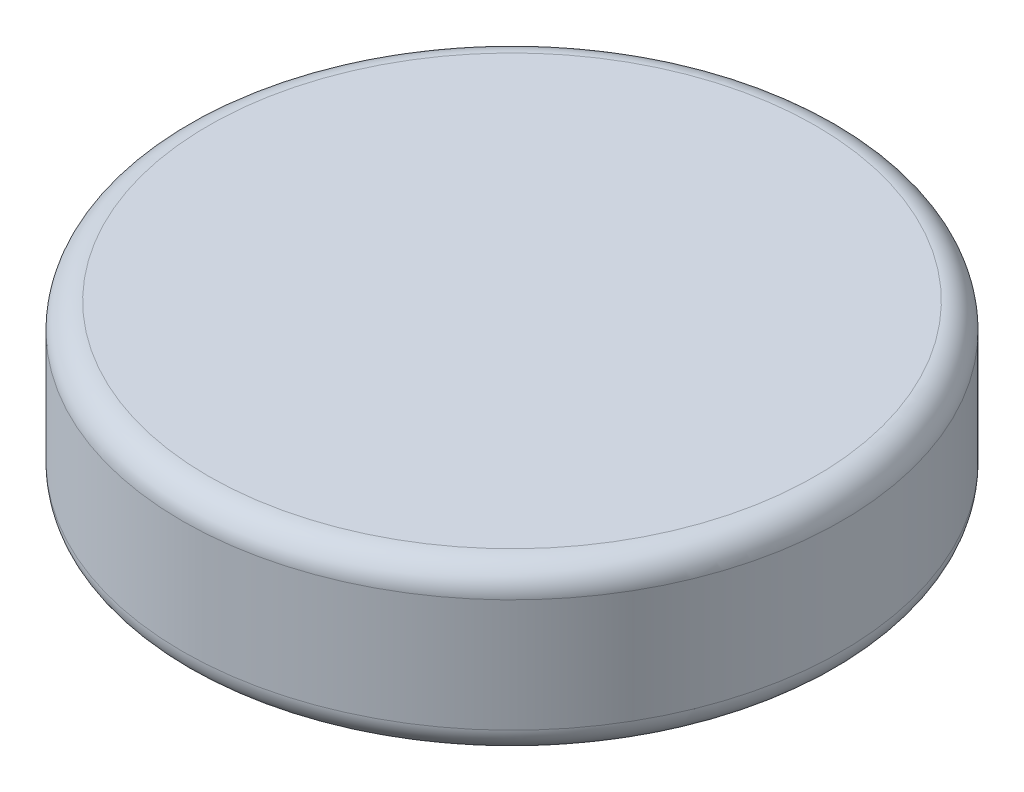
ISO-10303-21;
HEADER;
FILE_DESCRIPTION(('STEP AP214'),'2;1');
FILE_NAME('part.step','',(''),(''),'','','');
FILE_SCHEMA(('AUTOMOTIVE_DESIGN { 1 0 10303 214 1 1 1 1 }'));
ENDSEC;
DATA;
#1=APPLICATION_CONTEXT('core data for automotive mechanical design processes');
#2=APPLICATION_PROTOCOL_DEFINITION('international standard','automotive_design',2000,#1);
#3=PRODUCT_CONTEXT('',#1,'mechanical');
#4=PRODUCT('Part','Part','',(#3));
#5=PRODUCT_RELATED_PRODUCT_CATEGORY('part','',(#4));
#6=PRODUCT_DEFINITION_FORMATION('','',#4);
#7=PRODUCT_DEFINITION_CONTEXT('part definition',#1,'design');
#8=PRODUCT_DEFINITION('design','',#6,#7);
#9=PRODUCT_DEFINITION_SHAPE('','',#8);
#10=(LENGTH_UNIT() NAMED_UNIT(*) SI_UNIT(.MILLI.,.METRE.));
#11=(NAMED_UNIT(*) PLANE_ANGLE_UNIT() SI_UNIT($,.RADIAN.));
#12=(NAMED_UNIT(*) SI_UNIT($,.STERADIAN.) SOLID_ANGLE_UNIT());
#13=UNCERTAINTY_MEASURE_WITH_UNIT(LENGTH_MEASURE(1.E-05),#10,'distance_accuracy_value','');
#14=(GEOMETRIC_REPRESENTATION_CONTEXT(3) GLOBAL_UNCERTAINTY_ASSIGNED_CONTEXT((#13)) GLOBAL_UNIT_ASSIGNED_CONTEXT((#10,
#11,#12)) REPRESENTATION_CONTEXT('',''));
#15=CARTESIAN_POINT('',(0.,0.,0.));
#16=DIRECTION('',(0.,0.,1.));
#17=DIRECTION('',(1.,0.,0.));
#18=AXIS2_PLACEMENT_3D('',#15,#16,#17);
#19=CARTESIAN_POINT('',(0.,1.5875,0.));
#20=DIRECTION('',(0.,-1.,0.));
#21=DIRECTION('',(0.,0.,-1.));
#22=AXIS2_PLACEMENT_3D('',#19,#20,#21);
#23=CYLINDRICAL_SURFACE('',#22,3.175);
#24=CARTESIAN_POINT('',(0.,0.25,0.));
#25=DIRECTION('',(0.,1.,0.));
#26=DIRECTION('',(0.,0.,1.));
#27=AXIS2_PLACEMENT_3D('',#24,#25,#26);
#28=CIRCLE('',#27,3.175);
#29=CARTESIAN_POINT('',(0.,0.25,3.175));
#30=VERTEX_POINT('',#29);
#31=EDGE_CURVE('E42',#30,#30,#28,.T.);
#32=ORIENTED_EDGE('',*,*,#31,.T.);
#33=EDGE_LOOP('',(#32));
#34=FACE_BOUND('',#33,.T.);
#35=CARTESIAN_POINT('',(0.,1.3375,0.));
#36=DIRECTION('',(0.,1.,0.));
#37=DIRECTION('',(0.,0.,1.));
#38=AXIS2_PLACEMENT_3D('',#35,#36,#37);
#39=CIRCLE('',#38,3.175);
#40=CARTESIAN_POINT('',(0.,1.3375,3.175));
#41=VERTEX_POINT('',#40);
#42=EDGE_CURVE('E46',#41,#41,#39,.F.);
#43=ORIENTED_EDGE('',*,*,#42,.T.);
#44=EDGE_LOOP('',(#43));
#45=FACE_BOUND('',#44,.T.);
#46=ADVANCED_FACE('F31',(#34,#45),#23,.T.);
#47=CARTESIAN_POINT('',(0.,1.5875,0.));
#48=DIRECTION('',(0.,1.,0.));
#49=DIRECTION('',(0.,0.,1.));
#50=AXIS2_PLACEMENT_3D('',#47,#48,#49);
#51=PLANE('',#50);
#52=CARTESIAN_POINT('',(0.,1.5875,0.));
#53=DIRECTION('',(0.,1.,0.));
#54=DIRECTION('',(0.,0.,1.));
#55=AXIS2_PLACEMENT_3D('',#52,#53,#54);
#56=CIRCLE('',#55,2.925);
#57=CARTESIAN_POINT('',(0.,1.5875,2.925));
#58=VERTEX_POINT('',#57);
#59=EDGE_CURVE('E10',#58,#58,#56,.T.);
#60=ORIENTED_EDGE('',*,*,#59,.T.);
#61=EDGE_LOOP('',(#60));
#62=FACE_BOUND('',#61,.T.);
#63=ADVANCED_FACE('F62',(#62),#51,.T.);
#64=CARTESIAN_POINT('',(0.,0.,0.));
#65=DIRECTION('',(0.,1.,0.));
#66=DIRECTION('',(0.,0.,1.));
#67=AXIS2_PLACEMENT_3D('',#64,#65,#66);
#68=PLANE('',#67);
#69=CARTESIAN_POINT('',(0.,0.,0.));
#70=DIRECTION('',(0.,1.,0.));
#71=DIRECTION('',(0.,0.,1.));
#72=AXIS2_PLACEMENT_3D('',#69,#70,#71);
#73=CIRCLE('',#72,2.925);
#74=CARTESIAN_POINT('',(0.,0.,2.925));
#75=VERTEX_POINT('',#74);
#76=EDGE_CURVE('E38',#75,#75,#73,.F.);
#77=ORIENTED_EDGE('',*,*,#76,.T.);
#78=EDGE_LOOP('',(#77));
#79=FACE_BOUND('',#78,.T.);
#80=ADVANCED_FACE('F59',(#79),#68,.F.);
#81=CARTESIAN_POINT('',(0.,0.25,0.));
#82=DIRECTION('',(0.,1.,0.));
#83=DIRECTION('',(0.,0.,1.));
#84=AXIS2_PLACEMENT_3D('',#81,#82,#83);
#85=TOROIDAL_SURFACE('',#84,2.925,0.25);
#86=ORIENTED_EDGE('',*,*,#76,.F.);
#87=EDGE_LOOP('',(#86));
#88=FACE_BOUND('',#87,.T.);
#89=ORIENTED_EDGE('',*,*,#31,.F.);
#90=EDGE_LOOP('',(#89));
#91=FACE_BOUND('',#90,.T.);
#92=ADVANCED_FACE('F55',(#88,#91),#85,.T.);
#93=CARTESIAN_POINT('',(0.,1.3375,0.));
#94=DIRECTION('',(0.,1.,0.));
#95=DIRECTION('',(0.,0.,1.));
#96=AXIS2_PLACEMENT_3D('',#93,#94,#95);
#97=TOROIDAL_SURFACE('',#96,2.925,0.25);
#98=ORIENTED_EDGE('',*,*,#42,.F.);
#99=EDGE_LOOP('',(#98));
#100=FACE_BOUND('',#99,.T.);
#101=ORIENTED_EDGE('',*,*,#59,.F.);
#102=EDGE_LOOP('',(#101));
#103=FACE_BOUND('',#102,.T.);
#104=ADVANCED_FACE('F33',(#100,#103),#97,.T.);
#105=CLOSED_SHELL('',(#46,#63,#80,#92,#104));
#106=MANIFOLD_SOLID_BREP('B2',#105);
#107=ADVANCED_BREP_SHAPE_REPRESENTATION('',(#18,#106),#14);
#108=SHAPE_DEFINITION_REPRESENTATION(#9,#107);
ENDSEC;
END-ISO-10303-21;
